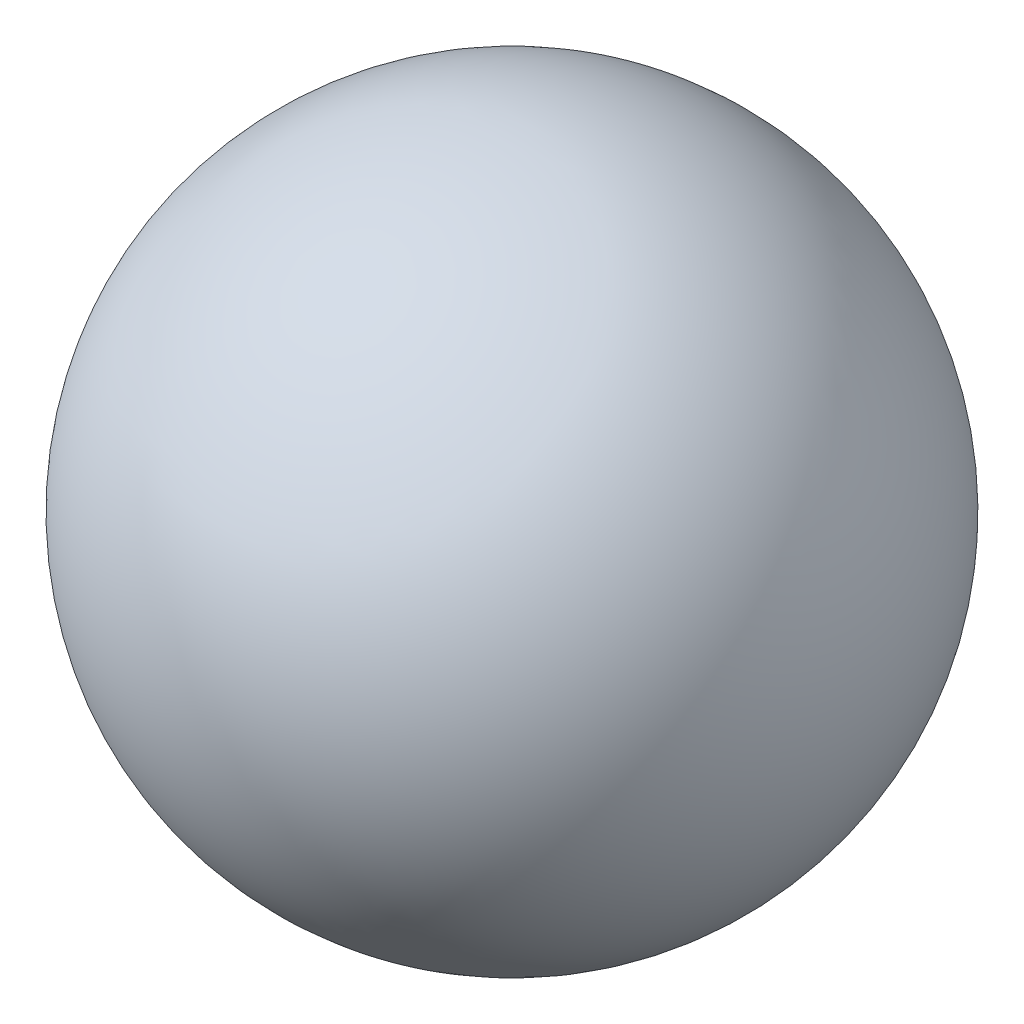
ISO-10303-21;
HEADER;
FILE_DESCRIPTION(('STEP AP214'),'2;1');
FILE_NAME('part.step','',(''),(''),'','','');
FILE_SCHEMA(('AUTOMOTIVE_DESIGN { 1 0 10303 214 1 1 1 1 }'));
ENDSEC;
DATA;
#1=APPLICATION_CONTEXT('core data for automotive mechanical design processes');
#2=APPLICATION_PROTOCOL_DEFINITION('international standard','automotive_design',2000,#1);
#3=PRODUCT_CONTEXT('',#1,'mechanical');
#4=PRODUCT('Part','Part','',(#3));
#5=PRODUCT_RELATED_PRODUCT_CATEGORY('part','',(#4));
#6=PRODUCT_DEFINITION_FORMATION('','',#4);
#7=PRODUCT_DEFINITION_CONTEXT('part definition',#1,'design');
#8=PRODUCT_DEFINITION('design','',#6,#7);
#9=PRODUCT_DEFINITION_SHAPE('','',#8);
#10=(LENGTH_UNIT() NAMED_UNIT(*) SI_UNIT(.MILLI.,.METRE.));
#11=(NAMED_UNIT(*) PLANE_ANGLE_UNIT() SI_UNIT($,.RADIAN.));
#12=(NAMED_UNIT(*) SI_UNIT($,.STERADIAN.) SOLID_ANGLE_UNIT());
#13=UNCERTAINTY_MEASURE_WITH_UNIT(LENGTH_MEASURE(1.E-05),#10,'distance_accuracy_value','');
#14=(GEOMETRIC_REPRESENTATION_CONTEXT(3) GLOBAL_UNCERTAINTY_ASSIGNED_CONTEXT((#13)) GLOBAL_UNIT_ASSIGNED_CONTEXT((#10,
#11,#12)) REPRESENTATION_CONTEXT('',''));
#15=CARTESIAN_POINT('',(0.,0.,0.));
#16=DIRECTION('',(0.,0.,1.));
#17=DIRECTION('',(1.,0.,0.));
#18=AXIS2_PLACEMENT_3D('',#15,#16,#17);
#19=CARTESIAN_POINT('',(57.535,-58.1563361683567,20.0989068290562));
#20=DIRECTION('',(0.,-0.945147382533446,0.326644187595884));
#21=DIRECTION('',(0.173648177666934,-0.321681728420801,-0.930788470058133));
#22=AXIS2_PLACEMENT_3D('',#19,#20,#21);
#23=SPHERICAL_SURFACE('',#22,6.75);
#24=CARTESIAN_POINT('',(57.535,-51.7765913362559,17.894058562784));
#25=VERTEX_POINT('',#24);
#26=VERTEX_LOOP('',#25);
#27=FACE_BOUND('',#26,.T.);
#28=CARTESIAN_POINT('',(57.535,-64.5360810004575,22.3037550953284));
#29=VERTEX_POINT('',#28);
#30=VERTEX_LOOP('',#29);
#31=FACE_BOUND('',#30,.T.);
#32=ADVANCED_FACE('F16',(#27,#31),#23,.T.);
#33=CLOSED_SHELL('',(#32));
#34=MANIFOLD_SOLID_BREP('B1',#33);
#35=ADVANCED_BREP_SHAPE_REPRESENTATION('',(#18,#34),#14);
#36=SHAPE_DEFINITION_REPRESENTATION(#9,#35);
ENDSEC;
END-ISO-10303-21;
